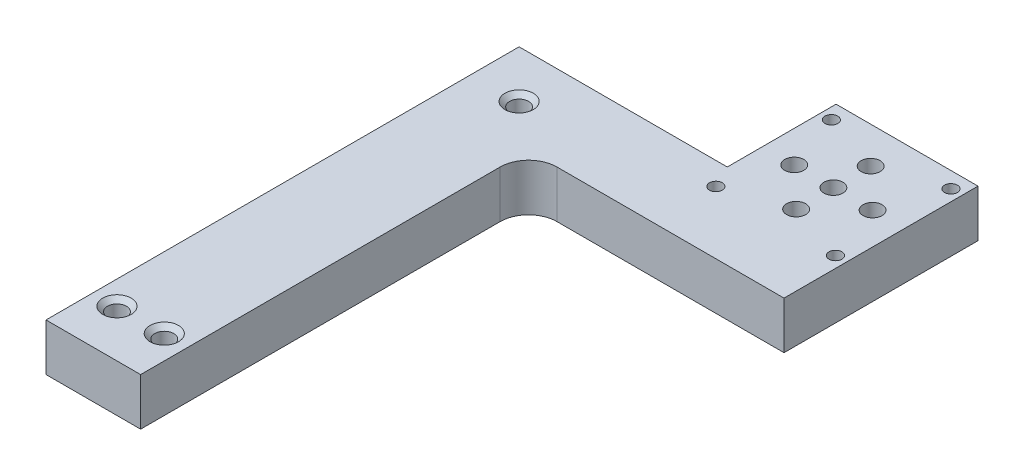
ISO-10303-21;
HEADER;
FILE_DESCRIPTION(('STEP AP214'),'2;1');
FILE_NAME('part.step','',(''),(''),'','','');
FILE_SCHEMA(('AUTOMOTIVE_DESIGN { 1 0 10303 214 1 1 1 1 }'));
ENDSEC;
DATA;
#1=APPLICATION_CONTEXT('core data for automotive mechanical design processes');
#2=APPLICATION_PROTOCOL_DEFINITION('international standard','automotive_design',2000,#1);
#3=PRODUCT_CONTEXT('',#1,'mechanical');
#4=PRODUCT('Part','Part','',(#3));
#5=PRODUCT_RELATED_PRODUCT_CATEGORY('part','',(#4));
#6=PRODUCT_DEFINITION_FORMATION('','',#4);
#7=PRODUCT_DEFINITION_CONTEXT('part definition',#1,'design');
#8=PRODUCT_DEFINITION('design','',#6,#7);
#9=PRODUCT_DEFINITION_SHAPE('','',#8);
#10=(LENGTH_UNIT() NAMED_UNIT(*) SI_UNIT(.MILLI.,.METRE.));
#11=(NAMED_UNIT(*) PLANE_ANGLE_UNIT() SI_UNIT($,.RADIAN.));
#12=(NAMED_UNIT(*) SI_UNIT($,.STERADIAN.) SOLID_ANGLE_UNIT());
#13=UNCERTAINTY_MEASURE_WITH_UNIT(LENGTH_MEASURE(1.E-05),#10,'distance_accuracy_value','');
#14=(GEOMETRIC_REPRESENTATION_CONTEXT(3) GLOBAL_UNCERTAINTY_ASSIGNED_CONTEXT((#13)) GLOBAL_UNIT_ASSIGNED_CONTEXT((#10,
#11,#12)) REPRESENTATION_CONTEXT('',''));
#15=CARTESIAN_POINT('',(0.,0.,0.));
#16=DIRECTION('',(0.,0.,1.));
#17=DIRECTION('',(1.,0.,0.));
#18=AXIS2_PLACEMENT_3D('',#15,#16,#17);
#19=CARTESIAN_POINT('',(62.23,12.7,-62.94));
#20=DIRECTION('',(0.,1.,0.));
#21=DIRECTION('',(0.,0.,1.));
#22=AXIS2_PLACEMENT_3D('',#19,#20,#21);
#23=CYLINDRICAL_SURFACE('',#22,2.55269999999999);
#24=CARTESIAN_POINT('',(62.23,0.,-62.94));
#25=DIRECTION('',(0.,1.,0.));
#26=DIRECTION('',(0.,0.,1.));
#27=AXIS2_PLACEMENT_3D('',#24,#25,#26);
#28=CIRCLE('',#27,2.55269999999999);
#29=CARTESIAN_POINT('',(62.23,0.,-60.3873));
#30=VERTEX_POINT('',#29);
#31=EDGE_CURVE('E126',#30,#30,#28,.T.);
#32=ORIENTED_EDGE('',*,*,#31,.F.);
#33=EDGE_LOOP('',(#32));
#34=FACE_BOUND('',#33,.T.);
#35=CARTESIAN_POINT('',(62.23,12.7,-62.94));
#36=DIRECTION('',(0.,1.,0.));
#37=DIRECTION('',(0.,0.,1.));
#38=AXIS2_PLACEMENT_3D('',#35,#36,#37);
#39=CIRCLE('',#38,2.55269999999999);
#40=CARTESIAN_POINT('',(62.23,12.7,-60.3873));
#41=VERTEX_POINT('',#40);
#42=EDGE_CURVE('E180',#41,#41,#39,.T.);
#43=ORIENTED_EDGE('',*,*,#42,.T.);
#44=EDGE_LOOP('',(#43));
#45=FACE_BOUND('',#44,.T.);
#46=ADVANCED_FACE('F37',(#34,#45),#23,.F.);
#47=CARTESIAN_POINT('',(12.7,12.7,-40.64));
#48=DIRECTION('',(-1.,0.,0.));
#49=DIRECTION('',(0.,0.,1.));
#50=AXIS2_PLACEMENT_3D('',#47,#48,#49);
#51=PLANE('',#50);
#52=DIRECTION('',(0.,0.,-1.));
#53=VECTOR('',#52,1.);
#54=CARTESIAN_POINT('',(12.7,0.,-40.64));
#55=LINE('',#54,#53);
#56=CARTESIAN_POINT('',(12.7,0.,63.5));
#57=VERTEX_POINT('',#56);
#58=CARTESIAN_POINT('',(12.7,0.,-33.02));
#59=VERTEX_POINT('',#58);
#60=EDGE_CURVE('E146',#57,#59,#55,.T.);
#61=ORIENTED_EDGE('',*,*,#60,.T.);
#62=DIRECTION('',(0.,-1.,0.));
#63=VECTOR('',#62,1.);
#64=CARTESIAN_POINT('',(12.7,12.7,-33.02));
#65=LINE('',#64,#63);
#66=CARTESIAN_POINT('',(12.7,12.7,-33.02));
#67=VERTEX_POINT('',#66);
#68=EDGE_CURVE('E52',#59,#67,#65,.F.);
#69=ORIENTED_EDGE('',*,*,#68,.T.);
#70=DIRECTION('',(0.,0.,-1.));
#71=VECTOR('',#70,1.);
#72=CARTESIAN_POINT('',(12.7,12.7,-40.64));
#73=LINE('',#72,#71);
#74=CARTESIAN_POINT('',(12.7,12.7,63.5));
#75=VERTEX_POINT('',#74);
#76=EDGE_CURVE('E118',#75,#67,#73,.T.);
#77=ORIENTED_EDGE('',*,*,#76,.F.);
#78=DIRECTION('',(0.,-1.,0.));
#79=VECTOR('',#78,1.);
#80=CARTESIAN_POINT('',(12.7,12.7,63.5));
#81=LINE('',#80,#79);
#82=EDGE_CURVE('E145',#75,#57,#81,.T.);
#83=ORIENTED_EDGE('',*,*,#82,.T.);
#84=EDGE_LOOP('',(#61,#69,#77,#83));
#85=FACE_BOUND('',#84,.T.);
#86=ADVANCED_FACE('F211',(#85),#51,.F.);
#87=CARTESIAN_POINT('',(12.7,12.7,-40.64));
#88=DIRECTION('',(0.,0.,-1.));
#89=DIRECTION('',(-1.,0.,0.));
#90=AXIS2_PLACEMENT_3D('',#87,#88,#89);
#91=PLANE('',#90);
#92=DIRECTION('',(1.,0.,0.));
#93=VECTOR('',#92,1.);
#94=CARTESIAN_POINT('',(12.7,12.7,-40.64));
#95=LINE('',#94,#93);
#96=CARTESIAN_POINT('',(20.32,12.7,-40.64));
#97=VERTEX_POINT('',#96);
#98=CARTESIAN_POINT('',(81.28,12.7,-40.64));
#99=VERTEX_POINT('',#98);
#100=EDGE_CURVE('E107',#97,#99,#95,.T.);
#101=ORIENTED_EDGE('',*,*,#100,.F.);
#102=DIRECTION('',(0.,-1.,0.));
#103=VECTOR('',#102,1.);
#104=CARTESIAN_POINT('',(20.32,0.,-40.64));
#105=LINE('',#104,#103);
#106=CARTESIAN_POINT('',(20.32,0.,-40.64));
#107=VERTEX_POINT('',#106);
#108=EDGE_CURVE('E183',#97,#107,#105,.T.);
#109=ORIENTED_EDGE('',*,*,#108,.T.);
#110=DIRECTION('',(1.,0.,0.));
#111=VECTOR('',#110,1.);
#112=CARTESIAN_POINT('',(12.7,0.,-40.64));
#113=LINE('',#112,#111);
#114=CARTESIAN_POINT('',(81.28,0.,-40.64));
#115=VERTEX_POINT('',#114);
#116=EDGE_CURVE('E123',#107,#115,#113,.T.);
#117=ORIENTED_EDGE('',*,*,#116,.T.);
#118=DIRECTION('',(0.,-1.,0.));
#119=VECTOR('',#118,1.);
#120=CARTESIAN_POINT('',(81.28,12.7,-40.64));
#121=LINE('',#120,#119);
#122=EDGE_CURVE('E121',#99,#115,#121,.T.);
#123=ORIENTED_EDGE('',*,*,#122,.F.);
#124=EDGE_LOOP('',(#101,#109,#117,#123));
#125=FACE_BOUND('',#124,.T.);
#126=ADVANCED_FACE('F122',(#125),#91,.F.);
#127=CARTESIAN_POINT('',(81.28,12.7,-40.64));
#128=DIRECTION('',(-1.,0.,0.));
#129=DIRECTION('',(0.,0.,1.));
#130=AXIS2_PLACEMENT_3D('',#127,#128,#129);
#131=PLANE('',#130);
#132=DIRECTION('',(0.,0.,-1.));
#133=VECTOR('',#132,1.);
#134=CARTESIAN_POINT('',(81.28,0.,-40.64));
#135=LINE('',#134,#133);
#136=CARTESIAN_POINT('',(81.28,0.,-92.71));
#137=VERTEX_POINT('',#136);
#138=EDGE_CURVE('E150',#115,#137,#135,.T.);
#139=ORIENTED_EDGE('',*,*,#138,.T.);
#140=DIRECTION('',(0.,-1.,0.));
#141=VECTOR('',#140,1.);
#142=CARTESIAN_POINT('',(81.28,12.7,-92.71));
#143=LINE('',#142,#141);
#144=CARTESIAN_POINT('',(81.28,12.7,-92.71));
#145=VERTEX_POINT('',#144);
#146=EDGE_CURVE('E127',#145,#137,#143,.T.);
#147=ORIENTED_EDGE('',*,*,#146,.F.);
#148=DIRECTION('',(0.,0.,-1.));
#149=VECTOR('',#148,1.);
#150=CARTESIAN_POINT('',(81.28,12.7,-40.64));
#151=LINE('',#150,#149);
#152=EDGE_CURVE('E112',#99,#145,#151,.T.);
#153=ORIENTED_EDGE('',*,*,#152,.F.);
#154=ORIENTED_EDGE('',*,*,#122,.T.);
#155=EDGE_LOOP('',(#139,#147,#153,#154));
#156=FACE_BOUND('',#155,.T.);
#157=ADVANCED_FACE('F129',(#156),#131,.F.);
#158=CARTESIAN_POINT('',(81.28,12.7,-92.71));
#159=DIRECTION('',(0.,0.,1.));
#160=DIRECTION('',(1.,0.,0.));
#161=AXIS2_PLACEMENT_3D('',#158,#159,#160);
#162=PLANE('',#161);
#163=DIRECTION('',(-1.,0.,0.));
#164=VECTOR('',#163,1.);
#165=CARTESIAN_POINT('',(81.28,0.,-92.71));
#166=LINE('',#165,#164);
#167=CARTESIAN_POINT('',(43.18,0.,-92.71));
#168=VERTEX_POINT('',#167);
#169=EDGE_CURVE('E152',#137,#168,#166,.T.);
#170=ORIENTED_EDGE('',*,*,#169,.T.);
#171=DIRECTION('',(0.,-1.,0.));
#172=VECTOR('',#171,1.);
#173=CARTESIAN_POINT('',(43.18,12.7,-92.71));
#174=LINE('',#173,#172);
#175=CARTESIAN_POINT('',(43.18,12.7,-92.71));
#176=VERTEX_POINT('',#175);
#177=EDGE_CURVE('E174',#176,#168,#174,.T.);
#178=ORIENTED_EDGE('',*,*,#177,.F.);
#179=DIRECTION('',(-1.,0.,0.));
#180=VECTOR('',#179,1.);
#181=CARTESIAN_POINT('',(81.28,12.7,-92.71));
#182=LINE('',#181,#180);
#183=EDGE_CURVE('E132',#145,#176,#182,.T.);
#184=ORIENTED_EDGE('',*,*,#183,.F.);
#185=ORIENTED_EDGE('',*,*,#146,.T.);
#186=EDGE_LOOP('',(#170,#178,#184,#185));
#187=FACE_BOUND('',#186,.T.);
#188=ADVANCED_FACE('F191',(#187),#162,.F.);
#189=CARTESIAN_POINT('',(43.18,12.7,-92.71));
#190=DIRECTION('',(1.,0.,0.));
#191=DIRECTION('',(0.,0.,-1.));
#192=AXIS2_PLACEMENT_3D('',#189,#190,#191);
#193=PLANE('',#192);
#194=DIRECTION('',(0.,0.,1.));
#195=VECTOR('',#194,1.);
#196=CARTESIAN_POINT('',(43.18,0.,-92.71));
#197=LINE('',#196,#195);
#198=CARTESIAN_POINT('',(43.18,0.,-63.5));
#199=VERTEX_POINT('',#198);
#200=EDGE_CURVE('E154',#168,#199,#197,.T.);
#201=ORIENTED_EDGE('',*,*,#200,.T.);
#202=DIRECTION('',(0.,-1.,0.));
#203=VECTOR('',#202,1.);
#204=CARTESIAN_POINT('',(43.18,12.7,-63.5));
#205=LINE('',#204,#203);
#206=CARTESIAN_POINT('',(43.18,12.7,-63.5));
#207=VERTEX_POINT('',#206);
#208=EDGE_CURVE('E171',#207,#199,#205,.T.);
#209=ORIENTED_EDGE('',*,*,#208,.F.);
#210=DIRECTION('',(0.,0.,1.));
#211=VECTOR('',#210,1.);
#212=CARTESIAN_POINT('',(43.18,12.7,-92.71));
#213=LINE('',#212,#211);
#214=EDGE_CURVE('E134',#176,#207,#213,.T.);
#215=ORIENTED_EDGE('',*,*,#214,.F.);
#216=ORIENTED_EDGE('',*,*,#177,.T.);
#217=EDGE_LOOP('',(#201,#209,#215,#216));
#218=FACE_BOUND('',#217,.T.);
#219=ADVANCED_FACE('F198',(#218),#193,.F.);
#220=CARTESIAN_POINT('',(-12.7,12.7,-63.5));
#221=DIRECTION('',(0.,0.,1.));
#222=DIRECTION('',(1.,0.,0.));
#223=AXIS2_PLACEMENT_3D('',#220,#221,#222);
#224=PLANE('',#223);
#225=DIRECTION('',(-1.,0.,0.));
#226=VECTOR('',#225,1.);
#227=CARTESIAN_POINT('',(-12.7,0.,-63.5));
#228=LINE('',#227,#226);
#229=CARTESIAN_POINT('',(-12.7,0.,-63.5));
#230=VERTEX_POINT('',#229);
#231=EDGE_CURVE('E157',#199,#230,#228,.T.);
#232=ORIENTED_EDGE('',*,*,#231,.T.);
#233=DIRECTION('',(0.,-1.,0.));
#234=VECTOR('',#233,1.);
#235=CARTESIAN_POINT('',(-12.7,12.7,-63.5));
#236=LINE('',#235,#234);
#237=CARTESIAN_POINT('',(-12.7,12.7,-63.5));
#238=VERTEX_POINT('',#237);
#239=EDGE_CURVE('E168',#238,#230,#236,.T.);
#240=ORIENTED_EDGE('',*,*,#239,.F.);
#241=DIRECTION('',(-1.,0.,0.));
#242=VECTOR('',#241,1.);
#243=CARTESIAN_POINT('',(12.7,12.7,-63.5));
#244=LINE('',#243,#242);
#245=EDGE_CURVE('E139',#207,#238,#244,.T.);
#246=ORIENTED_EDGE('',*,*,#245,.F.);
#247=ORIENTED_EDGE('',*,*,#208,.T.);
#248=EDGE_LOOP('',(#232,#240,#246,#247));
#249=FACE_BOUND('',#248,.T.);
#250=ADVANCED_FACE('F200',(#249),#224,.F.);
#251=CARTESIAN_POINT('',(-12.7,12.7,-63.5));
#252=DIRECTION('',(1.,0.,0.));
#253=DIRECTION('',(0.,0.,-1.));
#254=AXIS2_PLACEMENT_3D('',#251,#252,#253);
#255=PLANE('',#254);
#256=DIRECTION('',(0.,0.,1.));
#257=VECTOR('',#256,1.);
#258=CARTESIAN_POINT('',(-12.7,0.,-63.5));
#259=LINE('',#258,#257);
#260=CARTESIAN_POINT('',(-12.7,0.,63.5));
#261=VERTEX_POINT('',#260);
#262=EDGE_CURVE('E159',#230,#261,#259,.T.);
#263=ORIENTED_EDGE('',*,*,#262,.T.);
#264=DIRECTION('',(0.,-1.,0.));
#265=VECTOR('',#264,1.);
#266=CARTESIAN_POINT('',(-12.7,12.7,63.5));
#267=LINE('',#266,#265);
#268=CARTESIAN_POINT('',(-12.7,12.7,63.5));
#269=VERTEX_POINT('',#268);
#270=EDGE_CURVE('E165',#269,#261,#267,.T.);
#271=ORIENTED_EDGE('',*,*,#270,.F.);
#272=DIRECTION('',(0.,0.,1.));
#273=VECTOR('',#272,1.);
#274=CARTESIAN_POINT('',(-12.7,12.7,-63.5));
#275=LINE('',#274,#273);
#276=EDGE_CURVE('E141',#238,#269,#275,.T.);
#277=ORIENTED_EDGE('',*,*,#276,.F.);
#278=ORIENTED_EDGE('',*,*,#239,.T.);
#279=EDGE_LOOP('',(#263,#271,#277,#278));
#280=FACE_BOUND('',#279,.T.);
#281=ADVANCED_FACE('F205',(#280),#255,.F.);
#282=CARTESIAN_POINT('',(-12.7,12.7,63.5));
#283=DIRECTION('',(0.,0.,-1.));
#284=DIRECTION('',(-1.,0.,0.));
#285=AXIS2_PLACEMENT_3D('',#282,#283,#284);
#286=PLANE('',#285);
#287=DIRECTION('',(1.,0.,0.));
#288=VECTOR('',#287,1.);
#289=CARTESIAN_POINT('',(-12.7,0.,63.5));
#290=LINE('',#289,#288);
#291=EDGE_CURVE('E161',#261,#57,#290,.T.);
#292=ORIENTED_EDGE('',*,*,#291,.T.);
#293=ORIENTED_EDGE('',*,*,#82,.F.);
#294=DIRECTION('',(1.,0.,0.));
#295=VECTOR('',#294,1.);
#296=CARTESIAN_POINT('',(-12.7,12.7,63.5));
#297=LINE('',#296,#295);
#298=EDGE_CURVE('E143',#269,#75,#297,.T.);
#299=ORIENTED_EDGE('',*,*,#298,.F.);
#300=ORIENTED_EDGE('',*,*,#270,.T.);
#301=EDGE_LOOP('',(#292,#293,#299,#300));
#302=FACE_BOUND('',#301,.T.);
#303=ADVANCED_FACE('F209',(#302),#286,.F.);
#304=CARTESIAN_POINT('',(0.,12.7,0.));
#305=DIRECTION('',(0.,1.,0.));
#306=DIRECTION('',(0.,0.,1.));
#307=AXIS2_PLACEMENT_3D('',#304,#305,#306);
#308=PLANE('',#307);
#309=CARTESIAN_POINT('',(51.68,12.7,-72.9724131194938));
#310=DIRECTION('',(0.,1.,0.));
#311=DIRECTION('',(0.,0.,1.));
#312=AXIS2_PLACEMENT_3D('',#309,#310,#311);
#313=CIRCLE('',#312,2.55269999999999);
#314=CARTESIAN_POINT('',(51.68,12.7,-70.4197131194938));
#315=VERTEX_POINT('',#314);
#316=EDGE_CURVE('E284',#315,#315,#313,.T.);
#317=ORIENTED_EDGE('',*,*,#316,.F.);
#318=EDGE_LOOP('',(#317));
#319=FACE_BOUND('',#318,.T.);
#320=CARTESIAN_POINT('',(72.7123077199917,12.7,-72.9724131194938));
#321=DIRECTION('',(0.,1.,0.));
#322=DIRECTION('',(0.,0.,1.));
#323=AXIS2_PLACEMENT_3D('',#320,#321,#322);
#324=CIRCLE('',#323,2.55269999999999);
#325=CARTESIAN_POINT('',(72.7123077199917,12.7,-70.4197131194938));
#326=VERTEX_POINT('',#325);
#327=EDGE_CURVE('E278',#326,#326,#324,.T.);
#328=ORIENTED_EDGE('',*,*,#327,.F.);
#329=EDGE_LOOP('',(#328));
#330=FACE_BOUND('',#329,.T.);
#331=CARTESIAN_POINT('',(62.23,12.7,-72.94));
#332=DIRECTION('',(0.,1.,0.));
#333=DIRECTION('',(0.,0.,1.));
#334=AXIS2_PLACEMENT_3D('',#331,#332,#333);
#335=CIRCLE('',#334,2.55269999999999);
#336=CARTESIAN_POINT('',(62.23,12.7,-70.3873));
#337=VERTEX_POINT('',#336);
#338=EDGE_CURVE('E269',#337,#337,#335,.T.);
#339=ORIENTED_EDGE('',*,*,#338,.F.);
#340=EDGE_LOOP('',(#339));
#341=FACE_BOUND('',#340,.T.);
#342=CARTESIAN_POINT('',(62.23,12.7,-82.94));
#343=DIRECTION('',(0.,1.,0.));
#344=DIRECTION('',(0.,0.,1.));
#345=AXIS2_PLACEMENT_3D('',#342,#343,#344);
#346=CIRCLE('',#345,2.55269999999999);
#347=CARTESIAN_POINT('',(62.23,12.7,-80.3873));
#348=VERTEX_POINT('',#347);
#349=EDGE_CURVE('E266',#348,#348,#346,.T.);
#350=ORIENTED_EDGE('',*,*,#349,.F.);
#351=EDGE_LOOP('',(#350));
#352=FACE_BOUND('',#351,.T.);
#353=CARTESIAN_POINT('',(46.18,12.7,-88.44));
#354=DIRECTION('',(0.,1.,0.));
#355=DIRECTION('',(0.,0.,1.));
#356=AXIS2_PLACEMENT_3D('',#353,#354,#355);
#357=CIRCLE('',#356,1.72719999999999);
#358=CARTESIAN_POINT('',(46.18,12.7,-86.7128));
#359=VERTEX_POINT('',#358);
#360=EDGE_CURVE('E260',#359,#359,#357,.T.);
#361=ORIENTED_EDGE('',*,*,#360,.F.);
#362=EDGE_LOOP('',(#361));
#363=FACE_BOUND('',#362,.T.);
#364=CARTESIAN_POINT('',(78.28,12.7,-88.44));
#365=DIRECTION('',(0.,1.,0.));
#366=DIRECTION('',(0.,0.,1.));
#367=AXIS2_PLACEMENT_3D('',#364,#365,#366);
#368=CIRCLE('',#367,1.72719999999998);
#369=CARTESIAN_POINT('',(78.28,12.7,-86.7128));
#370=VERTEX_POINT('',#369);
#371=EDGE_CURVE('E254',#370,#370,#368,.T.);
#372=ORIENTED_EDGE('',*,*,#371,.F.);
#373=EDGE_LOOP('',(#372));
#374=FACE_BOUND('',#373,.T.);
#375=CARTESIAN_POINT('',(46.18,12.7,-57.44));
#376=DIRECTION('',(0.,1.,0.));
#377=DIRECTION('',(0.,0.,1.));
#378=AXIS2_PLACEMENT_3D('',#375,#376,#377);
#379=CIRCLE('',#378,1.72719999999999);
#380=CARTESIAN_POINT('',(46.18,12.7,-55.7128));
#381=VERTEX_POINT('',#380);
#382=EDGE_CURVE('E248',#381,#381,#379,.T.);
#383=ORIENTED_EDGE('',*,*,#382,.F.);
#384=EDGE_LOOP('',(#383));
#385=FACE_BOUND('',#384,.T.);
#386=CARTESIAN_POINT('',(78.28,12.7,-57.44));
#387=DIRECTION('',(0.,1.,0.));
#388=DIRECTION('',(0.,0.,1.));
#389=AXIS2_PLACEMENT_3D('',#386,#387,#388);
#390=CIRCLE('',#389,1.72719999999998);
#391=CARTESIAN_POINT('',(78.28,12.7,-55.7128));
#392=VERTEX_POINT('',#391);
#393=EDGE_CURVE('E242',#392,#392,#390,.T.);
#394=ORIENTED_EDGE('',*,*,#393,.F.);
#395=EDGE_LOOP('',(#394));
#396=FACE_BOUND('',#395,.T.);
#397=CARTESIAN_POINT('',(0.,12.7,-50.8));
#398=DIRECTION('',(0.,1.,0.));
#399=DIRECTION('',(0.,0.,1.));
#400=AXIS2_PLACEMENT_3D('',#397,#398,#399);
#401=CIRCLE('',#400,3.81);
#402=CARTESIAN_POINT('',(0.,12.7,-46.99));
#403=VERTEX_POINT('',#402);
#404=EDGE_CURVE('E236',#403,#403,#401,.T.);
#405=ORIENTED_EDGE('',*,*,#404,.F.);
#406=EDGE_LOOP('',(#405));
#407=FACE_BOUND('',#406,.T.);
#408=CARTESIAN_POINT('',(-6.34999999999999,12.7,50.8));
#409=DIRECTION('',(0.,1.,0.));
#410=DIRECTION('',(0.,0.,1.));
#411=AXIS2_PLACEMENT_3D('',#408,#409,#410);
#412=CIRCLE('',#411,3.81);
#413=CARTESIAN_POINT('',(-6.34999999999999,12.7,54.61));
#414=VERTEX_POINT('',#413);
#415=EDGE_CURVE('E227',#414,#414,#412,.T.);
#416=ORIENTED_EDGE('',*,*,#415,.F.);
#417=EDGE_LOOP('',(#416));
#418=FACE_BOUND('',#417,.T.);
#419=CARTESIAN_POINT('',(6.35000000000001,12.7,50.8));
#420=DIRECTION('',(0.,1.,0.));
#421=DIRECTION('',(0.,0.,1.));
#422=AXIS2_PLACEMENT_3D('',#419,#420,#421);
#423=CIRCLE('',#422,3.81);
#424=CARTESIAN_POINT('',(6.35000000000001,12.7,54.61));
#425=VERTEX_POINT('',#424);
#426=EDGE_CURVE('E218',#425,#425,#423,.T.);
#427=ORIENTED_EDGE('',*,*,#426,.F.);
#428=EDGE_LOOP('',(#427));
#429=FACE_BOUND('',#428,.T.);
#430=ORIENTED_EDGE('',*,*,#76,.T.);
#431=CARTESIAN_POINT('',(20.32,12.7,-33.02));
#432=DIRECTION('',(0.,1.,0.));
#433=DIRECTION('',(0.,0.,1.));
#434=AXIS2_PLACEMENT_3D('',#431,#432,#433);
#435=CIRCLE('',#434,7.62);
#436=EDGE_CURVE('E11',#67,#97,#435,.F.);
#437=ORIENTED_EDGE('',*,*,#436,.T.);
#438=ORIENTED_EDGE('',*,*,#100,.T.);
#439=ORIENTED_EDGE('',*,*,#152,.T.);
#440=ORIENTED_EDGE('',*,*,#183,.T.);
#441=ORIENTED_EDGE('',*,*,#214,.T.);
#442=ORIENTED_EDGE('',*,*,#245,.T.);
#443=ORIENTED_EDGE('',*,*,#276,.T.);
#444=ORIENTED_EDGE('',*,*,#298,.T.);
#445=EDGE_LOOP('',(#430,#437,#438,#439,#440,#441,#442,#443,#444));
#446=FACE_BOUND('',#445,.T.);
#447=ORIENTED_EDGE('',*,*,#42,.F.);
#448=EDGE_LOOP('',(#447));
#449=FACE_BOUND('',#448,.T.);
#450=ADVANCED_FACE('F109',(#319,#330,#341,#352,#363,#374,#385,#396,#407,#418,#429,#446,#449),
#308,.T.);
#451=CARTESIAN_POINT('',(0.,0.,0.));
#452=DIRECTION('',(0.,1.,0.));
#453=DIRECTION('',(0.,0.,1.));
#454=AXIS2_PLACEMENT_3D('',#451,#452,#453);
#455=PLANE('',#454);
#456=CARTESIAN_POINT('',(51.68,0.,-72.9724131194938));
#457=DIRECTION('',(0.,1.,0.));
#458=DIRECTION('',(0.,0.,1.));
#459=AXIS2_PLACEMENT_3D('',#456,#457,#458);
#460=CIRCLE('',#459,2.55269999999999);
#461=CARTESIAN_POINT('',(51.68,0.,-70.4197131194938));
#462=VERTEX_POINT('',#461);
#463=EDGE_CURVE('E281',#462,#462,#460,.T.);
#464=ORIENTED_EDGE('',*,*,#463,.T.);
#465=EDGE_LOOP('',(#464));
#466=FACE_BOUND('',#465,.T.);
#467=CARTESIAN_POINT('',(72.7123077199917,0.,-72.9724131194938));
#468=DIRECTION('',(0.,1.,0.));
#469=DIRECTION('',(0.,0.,1.));
#470=AXIS2_PLACEMENT_3D('',#467,#468,#469);
#471=CIRCLE('',#470,2.55269999999999);
#472=CARTESIAN_POINT('',(72.7123077199917,0.,-70.4197131194938));
#473=VERTEX_POINT('',#472);
#474=EDGE_CURVE('E275',#473,#473,#471,.T.);
#475=ORIENTED_EDGE('',*,*,#474,.T.);
#476=EDGE_LOOP('',(#475));
#477=FACE_BOUND('',#476,.T.);
#478=CARTESIAN_POINT('',(62.23,0.,-72.94));
#479=DIRECTION('',(0.,1.,0.));
#480=DIRECTION('',(0.,0.,1.));
#481=AXIS2_PLACEMENT_3D('',#478,#479,#480);
#482=CIRCLE('',#481,2.55269999999999);
#483=CARTESIAN_POINT('',(62.23,0.,-70.3873));
#484=VERTEX_POINT('',#483);
#485=EDGE_CURVE('E272',#484,#484,#482,.T.);
#486=ORIENTED_EDGE('',*,*,#485,.T.);
#487=EDGE_LOOP('',(#486));
#488=FACE_BOUND('',#487,.T.);
#489=CARTESIAN_POINT('',(62.23,0.,-82.94));
#490=DIRECTION('',(0.,1.,0.));
#491=DIRECTION('',(0.,0.,1.));
#492=AXIS2_PLACEMENT_3D('',#489,#490,#491);
#493=CIRCLE('',#492,2.55269999999999);
#494=CARTESIAN_POINT('',(62.23,0.,-80.3873));
#495=VERTEX_POINT('',#494);
#496=EDGE_CURVE('E263',#495,#495,#493,.T.);
#497=ORIENTED_EDGE('',*,*,#496,.T.);
#498=EDGE_LOOP('',(#497));
#499=FACE_BOUND('',#498,.T.);
#500=CARTESIAN_POINT('',(46.18,0.,-88.44));
#501=DIRECTION('',(0.,1.,0.));
#502=DIRECTION('',(0.,0.,1.));
#503=AXIS2_PLACEMENT_3D('',#500,#501,#502);
#504=CIRCLE('',#503,1.72719999999999);
#505=CARTESIAN_POINT('',(46.18,0.,-86.7128));
#506=VERTEX_POINT('',#505);
#507=EDGE_CURVE('E257',#506,#506,#504,.T.);
#508=ORIENTED_EDGE('',*,*,#507,.T.);
#509=EDGE_LOOP('',(#508));
#510=FACE_BOUND('',#509,.T.);
#511=CARTESIAN_POINT('',(78.28,0.,-88.44));
#512=DIRECTION('',(0.,1.,0.));
#513=DIRECTION('',(0.,0.,1.));
#514=AXIS2_PLACEMENT_3D('',#511,#512,#513);
#515=CIRCLE('',#514,1.72719999999999);
#516=CARTESIAN_POINT('',(78.28,0.,-86.7128));
#517=VERTEX_POINT('',#516);
#518=EDGE_CURVE('E251',#517,#517,#515,.T.);
#519=ORIENTED_EDGE('',*,*,#518,.T.);
#520=EDGE_LOOP('',(#519));
#521=FACE_BOUND('',#520,.T.);
#522=CARTESIAN_POINT('',(46.18,0.,-57.44));
#523=DIRECTION('',(0.,1.,0.));
#524=DIRECTION('',(0.,0.,1.));
#525=AXIS2_PLACEMENT_3D('',#522,#523,#524);
#526=CIRCLE('',#525,1.72719999999999);
#527=CARTESIAN_POINT('',(46.18,0.,-55.7128));
#528=VERTEX_POINT('',#527);
#529=EDGE_CURVE('E245',#528,#528,#526,.T.);
#530=ORIENTED_EDGE('',*,*,#529,.T.);
#531=EDGE_LOOP('',(#530));
#532=FACE_BOUND('',#531,.T.);
#533=CARTESIAN_POINT('',(78.28,0.,-57.44));
#534=DIRECTION('',(0.,1.,0.));
#535=DIRECTION('',(0.,0.,1.));
#536=AXIS2_PLACEMENT_3D('',#533,#534,#535);
#537=CIRCLE('',#536,1.72719999999999);
#538=CARTESIAN_POINT('',(78.28,0.,-55.7128));
#539=VERTEX_POINT('',#538);
#540=EDGE_CURVE('E239',#539,#539,#537,.T.);
#541=ORIENTED_EDGE('',*,*,#540,.T.);
#542=EDGE_LOOP('',(#541));
#543=FACE_BOUND('',#542,.T.);
#544=CARTESIAN_POINT('',(0.,0.,-50.8));
#545=DIRECTION('',(0.,1.,0.));
#546=DIRECTION('',(0.,0.,1.));
#547=AXIS2_PLACEMENT_3D('',#544,#545,#546);
#548=CIRCLE('',#547,2.5527);
#549=CARTESIAN_POINT('',(0.,0.,-48.2473));
#550=VERTEX_POINT('',#549);
#551=EDGE_CURVE('E230',#550,#550,#548,.T.);
#552=ORIENTED_EDGE('',*,*,#551,.T.);
#553=EDGE_LOOP('',(#552));
#554=FACE_BOUND('',#553,.T.);
#555=CARTESIAN_POINT('',(-6.34999999999999,0.,50.8));
#556=DIRECTION('',(0.,1.,0.));
#557=DIRECTION('',(0.,0.,1.));
#558=AXIS2_PLACEMENT_3D('',#555,#556,#557);
#559=CIRCLE('',#558,2.5527);
#560=CARTESIAN_POINT('',(-6.34999999999999,0.,53.3527));
#561=VERTEX_POINT('',#560);
#562=EDGE_CURVE('E221',#561,#561,#559,.T.);
#563=ORIENTED_EDGE('',*,*,#562,.T.);
#564=EDGE_LOOP('',(#563));
#565=FACE_BOUND('',#564,.T.);
#566=CARTESIAN_POINT('',(6.35000000000001,0.,50.8));
#567=DIRECTION('',(0.,1.,0.));
#568=DIRECTION('',(0.,0.,1.));
#569=AXIS2_PLACEMENT_3D('',#566,#567,#568);
#570=CIRCLE('',#569,2.5527);
#571=CARTESIAN_POINT('',(6.35000000000001,0.,53.3527));
#572=VERTEX_POINT('',#571);
#573=EDGE_CURVE('E148',#572,#572,#570,.T.);
#574=ORIENTED_EDGE('',*,*,#573,.T.);
#575=EDGE_LOOP('',(#574));
#576=FACE_BOUND('',#575,.T.);
#577=ORIENTED_EDGE('',*,*,#60,.F.);
#578=ORIENTED_EDGE('',*,*,#291,.F.);
#579=ORIENTED_EDGE('',*,*,#262,.F.);
#580=ORIENTED_EDGE('',*,*,#231,.F.);
#581=ORIENTED_EDGE('',*,*,#200,.F.);
#582=ORIENTED_EDGE('',*,*,#169,.F.);
#583=ORIENTED_EDGE('',*,*,#138,.F.);
#584=ORIENTED_EDGE('',*,*,#116,.F.);
#585=CARTESIAN_POINT('',(20.32,0.,-33.02));
#586=DIRECTION('',(0.,1.,0.));
#587=DIRECTION('',(0.,0.,1.));
#588=AXIS2_PLACEMENT_3D('',#585,#586,#587);
#589=CIRCLE('',#588,7.62);
#590=EDGE_CURVE('E45',#107,#59,#589,.T.);
#591=ORIENTED_EDGE('',*,*,#590,.T.);
#592=EDGE_LOOP('',(#577,#578,#579,#580,#581,#582,#583,#584,#591));
#593=FACE_BOUND('',#592,.T.);
#594=ORIENTED_EDGE('',*,*,#31,.T.);
#595=EDGE_LOOP('',(#594));
#596=FACE_BOUND('',#595,.T.);
#597=ADVANCED_FACE('F186',(#466,#477,#488,#499,#510,#521,#532,#543,#554,#565,#576,#593,#596),
#455,.F.);
#598=CARTESIAN_POINT('',(6.35000000000001,12.7,50.8));
#599=DIRECTION('',(0.,1.,0.));
#600=DIRECTION('',(0.,0.,1.));
#601=AXIS2_PLACEMENT_3D('',#598,#599,#600);
#602=CYLINDRICAL_SURFACE('',#601,2.5527);
#603=ORIENTED_EDGE('',*,*,#573,.F.);
#604=EDGE_LOOP('',(#603));
#605=FACE_BOUND('',#604,.T.);
#606=CARTESIAN_POINT('',(6.35000000000001,11.4427,50.8));
#607=DIRECTION('',(0.,1.,0.));
#608=DIRECTION('',(0.,0.,1.));
#609=AXIS2_PLACEMENT_3D('',#606,#607,#608);
#610=CIRCLE('',#609,2.5527);
#611=CARTESIAN_POINT('',(6.35000000000001,11.4427,53.3527));
#612=VERTEX_POINT('',#611);
#613=EDGE_CURVE('E215',#612,#612,#610,.T.);
#614=ORIENTED_EDGE('',*,*,#613,.T.);
#615=EDGE_LOOP('',(#614));
#616=FACE_BOUND('',#615,.T.);
#617=ADVANCED_FACE('F316',(#605,#616),#602,.F.);
#618=CARTESIAN_POINT('',(6.35000000000001,12.7,50.8));
#619=DIRECTION('',(0.,1.,0.));
#620=DIRECTION('',(0.,0.,1.));
#621=AXIS2_PLACEMENT_3D('',#618,#619,#620);
#622=CONICAL_SURFACE('',#621,3.81,0.785398163397448);
#623=ORIENTED_EDGE('',*,*,#613,.F.);
#624=EDGE_LOOP('',(#623));
#625=FACE_BOUND('',#624,.T.);
#626=ORIENTED_EDGE('',*,*,#426,.T.);
#627=EDGE_LOOP('',(#626));
#628=FACE_BOUND('',#627,.T.);
#629=ADVANCED_FACE('F313',(#625,#628),#622,.F.);
#630=CARTESIAN_POINT('',(-6.34999999999999,12.7,50.8));
#631=DIRECTION('',(0.,1.,0.));
#632=DIRECTION('',(0.,0.,1.));
#633=AXIS2_PLACEMENT_3D('',#630,#631,#632);
#634=CYLINDRICAL_SURFACE('',#633,2.5527);
#635=ORIENTED_EDGE('',*,*,#562,.F.);
#636=EDGE_LOOP('',(#635));
#637=FACE_BOUND('',#636,.T.);
#638=CARTESIAN_POINT('',(-6.34999999999999,11.4427,50.8));
#639=DIRECTION('',(0.,1.,0.));
#640=DIRECTION('',(0.,0.,1.));
#641=AXIS2_PLACEMENT_3D('',#638,#639,#640);
#642=CIRCLE('',#641,2.5527);
#643=CARTESIAN_POINT('',(-6.34999999999999,11.4427,53.3527));
#644=VERTEX_POINT('',#643);
#645=EDGE_CURVE('E224',#644,#644,#642,.T.);
#646=ORIENTED_EDGE('',*,*,#645,.T.);
#647=EDGE_LOOP('',(#646));
#648=FACE_BOUND('',#647,.T.);
#649=ADVANCED_FACE('F315',(#637,#648),#634,.F.);
#650=CARTESIAN_POINT('',(-6.34999999999999,12.7,50.8));
#651=DIRECTION('',(0.,1.,0.));
#652=DIRECTION('',(0.,0.,1.));
#653=AXIS2_PLACEMENT_3D('',#650,#651,#652);
#654=CONICAL_SURFACE('',#653,3.81,0.785398163397448);
#655=ORIENTED_EDGE('',*,*,#645,.F.);
#656=EDGE_LOOP('',(#655));
#657=FACE_BOUND('',#656,.T.);
#658=ORIENTED_EDGE('',*,*,#415,.T.);
#659=EDGE_LOOP('',(#658));
#660=FACE_BOUND('',#659,.T.);
#661=ADVANCED_FACE('F323',(#657,#660),#654,.F.);
#662=CARTESIAN_POINT('',(0.,12.7,-50.8));
#663=DIRECTION('',(0.,1.,0.));
#664=DIRECTION('',(0.,0.,1.));
#665=AXIS2_PLACEMENT_3D('',#662,#663,#664);
#666=CYLINDRICAL_SURFACE('',#665,2.5527);
#667=ORIENTED_EDGE('',*,*,#551,.F.);
#668=EDGE_LOOP('',(#667));
#669=FACE_BOUND('',#668,.T.);
#670=CARTESIAN_POINT('',(0.,11.4427,-50.8));
#671=DIRECTION('',(0.,1.,0.));
#672=DIRECTION('',(0.,0.,1.));
#673=AXIS2_PLACEMENT_3D('',#670,#671,#672);
#674=CIRCLE('',#673,2.5527);
#675=CARTESIAN_POINT('',(0.,11.4427,-48.2473));
#676=VERTEX_POINT('',#675);
#677=EDGE_CURVE('E233',#676,#676,#674,.T.);
#678=ORIENTED_EDGE('',*,*,#677,.T.);
#679=EDGE_LOOP('',(#678));
#680=FACE_BOUND('',#679,.T.);
#681=ADVANCED_FACE('F385',(#669,#680),#666,.F.);
#682=CARTESIAN_POINT('',(0.,12.7,-50.8));
#683=DIRECTION('',(0.,1.,0.));
#684=DIRECTION('',(0.,0.,1.));
#685=AXIS2_PLACEMENT_3D('',#682,#683,#684);
#686=CONICAL_SURFACE('',#685,3.81,0.785398163397448);
#687=ORIENTED_EDGE('',*,*,#677,.F.);
#688=EDGE_LOOP('',(#687));
#689=FACE_BOUND('',#688,.T.);
#690=ORIENTED_EDGE('',*,*,#404,.T.);
#691=EDGE_LOOP('',(#690));
#692=FACE_BOUND('',#691,.T.);
#693=ADVANCED_FACE('F390',(#689,#692),#686,.F.);
#694=CARTESIAN_POINT('',(78.28,12.7,-57.44));
#695=DIRECTION('',(0.,1.,0.));
#696=DIRECTION('',(0.,0.,1.));
#697=AXIS2_PLACEMENT_3D('',#694,#695,#696);
#698=CYLINDRICAL_SURFACE('',#697,1.72719999999999);
#699=ORIENTED_EDGE('',*,*,#540,.F.);
#700=EDGE_LOOP('',(#699));
#701=FACE_BOUND('',#700,.T.);
#702=ORIENTED_EDGE('',*,*,#393,.T.);
#703=EDGE_LOOP('',(#702));
#704=FACE_BOUND('',#703,.T.);
#705=ADVANCED_FACE('F396',(#701,#704),#698,.F.);
#706=CARTESIAN_POINT('',(46.18,12.7,-57.44));
#707=DIRECTION('',(0.,1.,0.));
#708=DIRECTION('',(0.,0.,1.));
#709=AXIS2_PLACEMENT_3D('',#706,#707,#708);
#710=CYLINDRICAL_SURFACE('',#709,1.72719999999999);
#711=ORIENTED_EDGE('',*,*,#529,.F.);
#712=EDGE_LOOP('',(#711));
#713=FACE_BOUND('',#712,.T.);
#714=ORIENTED_EDGE('',*,*,#382,.T.);
#715=EDGE_LOOP('',(#714));
#716=FACE_BOUND('',#715,.T.);
#717=ADVANCED_FACE('F400',(#713,#716),#710,.F.);
#718=CARTESIAN_POINT('',(78.28,12.7,-88.44));
#719=DIRECTION('',(0.,1.,0.));
#720=DIRECTION('',(0.,0.,1.));
#721=AXIS2_PLACEMENT_3D('',#718,#719,#720);
#722=CYLINDRICAL_SURFACE('',#721,1.72719999999999);
#723=ORIENTED_EDGE('',*,*,#518,.F.);
#724=EDGE_LOOP('',(#723));
#725=FACE_BOUND('',#724,.T.);
#726=ORIENTED_EDGE('',*,*,#371,.T.);
#727=EDGE_LOOP('',(#726));
#728=FACE_BOUND('',#727,.T.);
#729=ADVANCED_FACE('F404',(#725,#728),#722,.F.);
#730=CARTESIAN_POINT('',(46.18,12.7,-88.44));
#731=DIRECTION('',(0.,1.,0.));
#732=DIRECTION('',(0.,0.,1.));
#733=AXIS2_PLACEMENT_3D('',#730,#731,#732);
#734=CYLINDRICAL_SURFACE('',#733,1.72719999999999);
#735=ORIENTED_EDGE('',*,*,#507,.F.);
#736=EDGE_LOOP('',(#735));
#737=FACE_BOUND('',#736,.T.);
#738=ORIENTED_EDGE('',*,*,#360,.T.);
#739=EDGE_LOOP('',(#738));
#740=FACE_BOUND('',#739,.T.);
#741=ADVANCED_FACE('F408',(#737,#740),#734,.F.);
#742=CARTESIAN_POINT('',(62.23,12.7,-82.94));
#743=DIRECTION('',(0.,1.,0.));
#744=DIRECTION('',(0.,0.,1.));
#745=AXIS2_PLACEMENT_3D('',#742,#743,#744);
#746=CYLINDRICAL_SURFACE('',#745,2.55269999999999);
#747=ORIENTED_EDGE('',*,*,#496,.F.);
#748=EDGE_LOOP('',(#747));
#749=FACE_BOUND('',#748,.T.);
#750=ORIENTED_EDGE('',*,*,#349,.T.);
#751=EDGE_LOOP('',(#750));
#752=FACE_BOUND('',#751,.T.);
#753=ADVANCED_FACE('F412',(#749,#752),#746,.F.);
#754=CARTESIAN_POINT('',(62.23,12.7,-72.94));
#755=DIRECTION('',(0.,1.,0.));
#756=DIRECTION('',(0.,0.,1.));
#757=AXIS2_PLACEMENT_3D('',#754,#755,#756);
#758=CYLINDRICAL_SURFACE('',#757,2.55269999999999);
#759=ORIENTED_EDGE('',*,*,#485,.F.);
#760=EDGE_LOOP('',(#759));
#761=FACE_BOUND('',#760,.T.);
#762=ORIENTED_EDGE('',*,*,#338,.T.);
#763=EDGE_LOOP('',(#762));
#764=FACE_BOUND('',#763,.T.);
#765=ADVANCED_FACE('F416',(#761,#764),#758,.F.);
#766=CARTESIAN_POINT('',(72.7123077199917,12.7,-72.9724131194938));
#767=DIRECTION('',(0.,1.,0.));
#768=DIRECTION('',(0.,0.,1.));
#769=AXIS2_PLACEMENT_3D('',#766,#767,#768);
#770=CYLINDRICAL_SURFACE('',#769,2.55269999999999);
#771=ORIENTED_EDGE('',*,*,#474,.F.);
#772=EDGE_LOOP('',(#771));
#773=FACE_BOUND('',#772,.T.);
#774=ORIENTED_EDGE('',*,*,#327,.T.);
#775=EDGE_LOOP('',(#774));
#776=FACE_BOUND('',#775,.T.);
#777=ADVANCED_FACE('F420',(#773,#776),#770,.F.);
#778=CARTESIAN_POINT('',(51.68,12.7,-72.9724131194938));
#779=DIRECTION('',(0.,1.,0.));
#780=DIRECTION('',(0.,0.,1.));
#781=AXIS2_PLACEMENT_3D('',#778,#779,#780);
#782=CYLINDRICAL_SURFACE('',#781,2.55269999999999);
#783=ORIENTED_EDGE('',*,*,#463,.F.);
#784=EDGE_LOOP('',(#783));
#785=FACE_BOUND('',#784,.T.);
#786=ORIENTED_EDGE('',*,*,#316,.T.);
#787=EDGE_LOOP('',(#786));
#788=FACE_BOUND('',#787,.T.);
#789=ADVANCED_FACE('F288',(#785,#788),#782,.F.);
#790=CARTESIAN_POINT('',(20.32,12.7,-33.02));
#791=DIRECTION('',(0.,1.,0.));
#792=DIRECTION('',(0.,0.,1.));
#793=AXIS2_PLACEMENT_3D('',#790,#791,#792);
#794=CYLINDRICAL_SURFACE('',#793,7.62);
#795=ORIENTED_EDGE('',*,*,#436,.F.);
#796=ORIENTED_EDGE('',*,*,#68,.F.);
#797=ORIENTED_EDGE('',*,*,#590,.F.);
#798=ORIENTED_EDGE('',*,*,#108,.F.);
#799=EDGE_LOOP('',(#795,#796,#797,#798));
#800=FACE_BOUND('',#799,.T.);
#801=ADVANCED_FACE('F39',(#800),#794,.F.);
#802=CLOSED_SHELL('',(#46,#86,#126,#157,#188,#219,#250,#281,#303,#450,#597,#617,#629,#649,#661,
#681,#693,#705,#717,#729,#741,#753,#765,#777,#789,#801));
#803=MANIFOLD_SOLID_BREP('B2',#802);
#804=ADVANCED_BREP_SHAPE_REPRESENTATION('',(#18,#803),#14);
#805=SHAPE_DEFINITION_REPRESENTATION(#9,#804);
ENDSEC;
END-ISO-10303-21;
